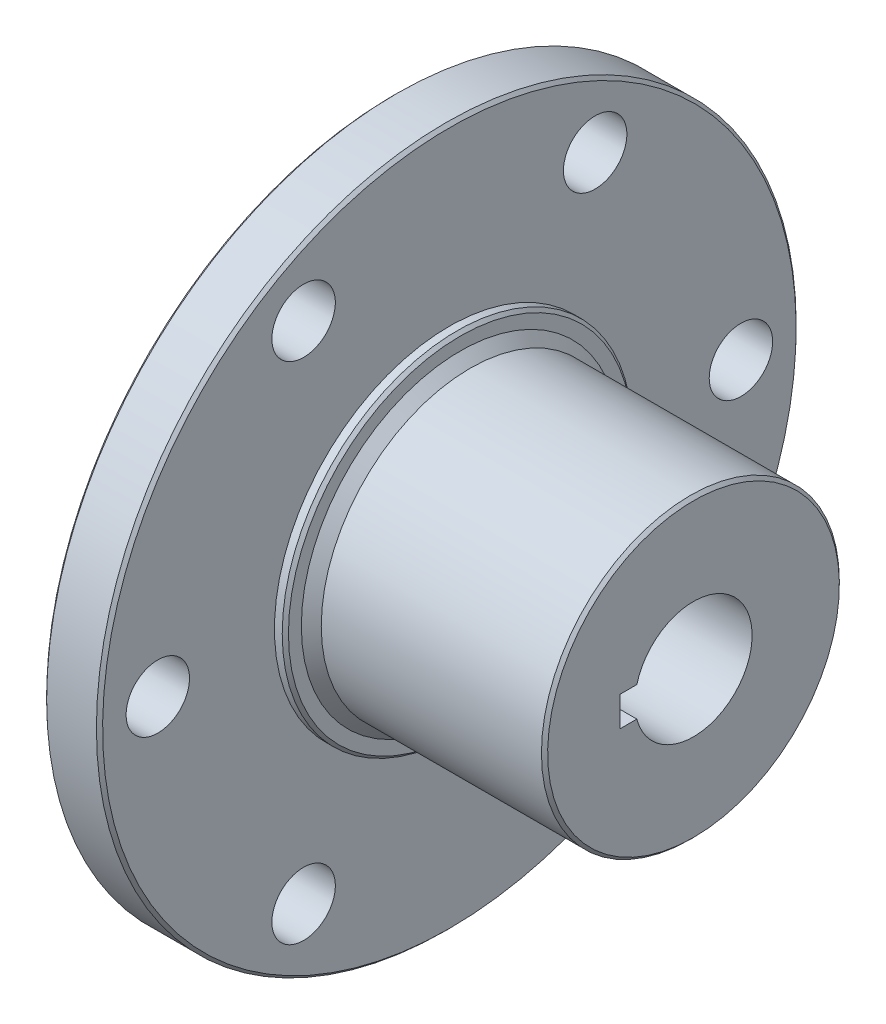
ISO-10303-21;
HEADER;
FILE_DESCRIPTION(('STEP AP214'),'2;1');
FILE_NAME('part.step','',(''),(''),'','','');
FILE_SCHEMA(('AUTOMOTIVE_DESIGN { 1 0 10303 214 1 1 1 1 }'));
ENDSEC;
DATA;
#1=APPLICATION_CONTEXT('core data for automotive mechanical design processes');
#2=APPLICATION_PROTOCOL_DEFINITION('international standard','automotive_design',2000,#1);
#3=PRODUCT_CONTEXT('',#1,'mechanical');
#4=PRODUCT('Part','Part','',(#3));
#5=PRODUCT_RELATED_PRODUCT_CATEGORY('part','',(#4));
#6=PRODUCT_DEFINITION_FORMATION('','',#4);
#7=PRODUCT_DEFINITION_CONTEXT('part definition',#1,'design');
#8=PRODUCT_DEFINITION('design','',#6,#7);
#9=PRODUCT_DEFINITION_SHAPE('','',#8);
#10=(LENGTH_UNIT() NAMED_UNIT(*) SI_UNIT(.MILLI.,.METRE.));
#11=(NAMED_UNIT(*) PLANE_ANGLE_UNIT() SI_UNIT($,.RADIAN.));
#12=(NAMED_UNIT(*) SI_UNIT($,.STERADIAN.) SOLID_ANGLE_UNIT());
#13=UNCERTAINTY_MEASURE_WITH_UNIT(LENGTH_MEASURE(1.E-05),#10,'distance_accuracy_value','');
#14=(GEOMETRIC_REPRESENTATION_CONTEXT(3) GLOBAL_UNCERTAINTY_ASSIGNED_CONTEXT((#13)) GLOBAL_UNIT_ASSIGNED_CONTEXT((#10,
#11,#12)) REPRESENTATION_CONTEXT('',''));
#15=CARTESIAN_POINT('',(0.,0.,0.));
#16=DIRECTION('',(0.,0.,1.));
#17=DIRECTION('',(1.,0.,0.));
#18=AXIS2_PLACEMENT_3D('',#15,#16,#17);
#19=CARTESIAN_POINT('',(7.79293375394319,-1.2192,4.63006887313785));
#20=DIRECTION('',(0.,-1.,0.));
#21=DIRECTION('',(0.,0.,-1.));
#22=AXIS2_PLACEMENT_3D('',#19,#20,#21);
#23=PLANE('',#22);
#24=DIRECTION('',(1.,0.,0.));
#25=VECTOR('',#24,1.);
#26=CARTESIAN_POINT('',(7.79293375394319,-1.2192,6.0071));
#27=LINE('',#26,#25);
#28=CARTESIAN_POINT('',(-17.6070662460568,-1.2192,6.0071));
#29=VERTEX_POINT('',#28);
#30=CARTESIAN_POINT('',(7.79293375394319,-1.2192,6.0071));
#31=VERTEX_POINT('',#30);
#32=EDGE_CURVE('E62',#29,#31,#27,.T.);
#33=ORIENTED_EDGE('',*,*,#32,.T.);
#34=DIRECTION('',(0.,0.,-1.));
#35=VECTOR('',#34,1.);
#36=CARTESIAN_POINT('',(7.79293375394319,-1.2192,0.));
#37=LINE('',#36,#35);
#38=CARTESIAN_POINT('',(7.79293375394319,-1.2192,4.63006887313785));
#39=VERTEX_POINT('',#38);
#40=EDGE_CURVE('E58',#39,#31,#37,.F.);
#41=ORIENTED_EDGE('',*,*,#40,.F.);
#42=DIRECTION('',(-1.,0.,0.));
#43=VECTOR('',#42,1.);
#44=CARTESIAN_POINT('',(7.79293375394323,-1.2192,4.63006887313785));
#45=LINE('',#44,#43);
#46=CARTESIAN_POINT('',(-17.6070662460568,-1.2192,4.63006887313785));
#47=VERTEX_POINT('',#46);
#48=EDGE_CURVE('E60',#39,#47,#45,.T.);
#49=ORIENTED_EDGE('',*,*,#48,.T.);
#50=DIRECTION('',(0.,0.,-1.));
#51=VECTOR('',#50,1.);
#52=CARTESIAN_POINT('',(-17.6070662460568,-1.2192,4.63006887313785));
#53=LINE('',#52,#51);
#54=EDGE_CURVE('E35',#29,#47,#53,.T.);
#55=ORIENTED_EDGE('',*,*,#54,.F.);
#56=EDGE_LOOP('',(#33,#41,#49,#55));
#57=FACE_BOUND('',#56,.T.);
#58=ADVANCED_FACE('F17',(#57),#23,.F.);
#59=CARTESIAN_POINT('',(7.79293375394319,0.,0.));
#60=DIRECTION('',(1.,0.,0.));
#61=DIRECTION('',(0.,0.,-1.));
#62=AXIS2_PLACEMENT_3D('',#59,#60,#61);
#63=PLANE('',#62);
#64=DIRECTION('',(0.,-1.,0.));
#65=VECTOR('',#64,1.);
#66=CARTESIAN_POINT('',(7.79293375394319,-1.2192,6.0071));
#67=LINE('',#66,#65);
#68=CARTESIAN_POINT('',(7.79293375394319,1.2192,6.0071));
#69=VERTEX_POINT('',#68);
#70=EDGE_CURVE('E100',#31,#69,#67,.F.);
#71=ORIENTED_EDGE('',*,*,#70,.T.);
#72=DIRECTION('',(0.,0.,1.));
#73=VECTOR('',#72,1.);
#74=CARTESIAN_POINT('',(7.79293375394319,1.2192,6.0071));
#75=LINE('',#74,#73);
#76=CARTESIAN_POINT('',(7.79293375394319,1.2192,4.63006887313785));
#77=VERTEX_POINT('',#76);
#78=EDGE_CURVE('E54',#69,#77,#75,.F.);
#79=ORIENTED_EDGE('',*,*,#78,.T.);
#80=CARTESIAN_POINT('',(7.79293375394319,0.,0.));
#81=DIRECTION('',(-1.,0.,0.));
#82=DIRECTION('',(0.,0.,1.));
#83=AXIS2_PLACEMENT_3D('',#80,#81,#82);
#84=CIRCLE('',#83,4.7879);
#85=EDGE_CURVE('E66',#77,#39,#84,.T.);
#86=ORIENTED_EDGE('',*,*,#85,.T.);
#87=ORIENTED_EDGE('',*,*,#40,.T.);
#88=EDGE_LOOP('',(#71,#79,#86,#87));
#89=FACE_BOUND('',#88,.T.);
#90=CARTESIAN_POINT('',(7.79293375394319,0.,0.));
#91=DIRECTION('',(-1.,0.,0.));
#92=DIRECTION('',(0.,-1.,0.));
#93=AXIS2_PLACEMENT_3D('',#90,#91,#92);
#94=CIRCLE('',#93,11.9126);
#95=CARTESIAN_POINT('',(7.79293375394319,-11.9126,0.));
#96=VERTEX_POINT('',#95);
#97=EDGE_CURVE('E20',#96,#96,#94,.T.);
#98=ORIENTED_EDGE('',*,*,#97,.F.);
#99=EDGE_LOOP('',(#98));
#100=FACE_BOUND('',#99,.T.);
#101=ADVANCED_FACE('F67',(#89,#100),#63,.T.);
#102=CARTESIAN_POINT('',(7.79293375394319,1.2192,6.0071));
#103=DIRECTION('',(0.,1.,0.));
#104=DIRECTION('',(0.,0.,1.));
#105=AXIS2_PLACEMENT_3D('',#102,#103,#104);
#106=PLANE('',#105);
#107=DIRECTION('',(-1.,0.,0.));
#108=VECTOR('',#107,1.);
#109=CARTESIAN_POINT('',(7.79293375394323,1.2192,4.63006887313785));
#110=LINE('',#109,#108);
#111=CARTESIAN_POINT('',(-17.6070662460568,1.2192,4.63006887313785));
#112=VERTEX_POINT('',#111);
#113=EDGE_CURVE('E71',#112,#77,#110,.F.);
#114=ORIENTED_EDGE('',*,*,#113,.T.);
#115=ORIENTED_EDGE('',*,*,#78,.F.);
#116=DIRECTION('',(1.,0.,0.));
#117=VECTOR('',#116,1.);
#118=CARTESIAN_POINT('',(7.79293375394319,1.2192,6.0071));
#119=LINE('',#118,#117);
#120=CARTESIAN_POINT('',(-17.6070662460568,1.2192,6.0071));
#121=VERTEX_POINT('',#120);
#122=EDGE_CURVE('E85',#69,#121,#119,.F.);
#123=ORIENTED_EDGE('',*,*,#122,.T.);
#124=DIRECTION('',(0.,0.,1.));
#125=VECTOR('',#124,1.);
#126=CARTESIAN_POINT('',(-17.6070662460568,1.2192,6.0071));
#127=LINE('',#126,#125);
#128=EDGE_CURVE('E78',#112,#121,#127,.T.);
#129=ORIENTED_EDGE('',*,*,#128,.F.);
#130=EDGE_LOOP('',(#114,#115,#123,#129));
#131=FACE_BOUND('',#130,.T.);
#132=ADVANCED_FACE('F179',(#131),#106,.F.);
#133=CARTESIAN_POINT('',(7.53893375394322,0.,0.));
#134=DIRECTION('',(-1.,0.,0.));
#135=DIRECTION('',(0.,-1.,0.));
#136=AXIS2_PLACEMENT_3D('',#133,#134,#135);
#137=CONICAL_SURFACE('',#136,12.1666,0.785398163397438);
#138=ORIENTED_EDGE('',*,*,#97,.T.);
#139=EDGE_LOOP('',(#138));
#140=FACE_BOUND('',#139,.T.);
#141=CARTESIAN_POINT('',(7.53893375394322,0.,0.));
#142=DIRECTION('',(-1.,0.,0.));
#143=DIRECTION('',(0.,0.,1.));
#144=AXIS2_PLACEMENT_3D('',#141,#142,#143);
#145=CIRCLE('',#144,12.1666);
#146=CARTESIAN_POINT('',(7.53893375394322,0.,12.1666));
#147=VERTEX_POINT('',#146);
#148=EDGE_CURVE('E83',#147,#147,#145,.T.);
#149=ORIENTED_EDGE('',*,*,#148,.F.);
#150=EDGE_LOOP('',(#149));
#151=FACE_BOUND('',#150,.T.);
#152=ADVANCED_FACE('F181',(#140,#151),#137,.T.);
#153=CARTESIAN_POINT('',(7.79293375394323,0.,0.));
#154=DIRECTION('',(-1.,0.,0.));
#155=DIRECTION('',(0.,0.,1.));
#156=AXIS2_PLACEMENT_3D('',#153,#154,#155);
#157=CYLINDRICAL_SURFACE('',#156,4.7879);
#158=ORIENTED_EDGE('',*,*,#113,.F.);
#159=CARTESIAN_POINT('',(-17.6070662460568,0.,0.));
#160=DIRECTION('',(-1.,0.,0.));
#161=DIRECTION('',(0.,0.,1.));
#162=AXIS2_PLACEMENT_3D('',#159,#160,#161);
#163=CIRCLE('',#162,4.7879);
#164=EDGE_CURVE('E74',#47,#112,#163,.F.);
#165=ORIENTED_EDGE('',*,*,#164,.F.);
#166=ORIENTED_EDGE('',*,*,#48,.F.);
#167=ORIENTED_EDGE('',*,*,#85,.F.);
#168=EDGE_LOOP('',(#158,#165,#166,#167));
#169=FACE_BOUND('',#168,.T.);
#170=ADVANCED_FACE('F72',(#169),#157,.F.);
#171=CARTESIAN_POINT('',(7.79293375394319,-1.2192,6.0071));
#172=DIRECTION('',(0.,0.,1.));
#173=DIRECTION('',(0.,-1.,0.));
#174=AXIS2_PLACEMENT_3D('',#171,#172,#173);
#175=PLANE('',#174);
#176=ORIENTED_EDGE('',*,*,#122,.F.);
#177=ORIENTED_EDGE('',*,*,#70,.F.);
#178=ORIENTED_EDGE('',*,*,#32,.F.);
#179=DIRECTION('',(0.,1.,0.));
#180=VECTOR('',#179,1.);
#181=CARTESIAN_POINT('',(-17.6070662460568,28.575,6.0071));
#182=LINE('',#181,#180);
#183=EDGE_CURVE('E103',#121,#29,#182,.F.);
#184=ORIENTED_EDGE('',*,*,#183,.F.);
#185=EDGE_LOOP('',(#176,#177,#178,#184));
#186=FACE_BOUND('',#185,.T.);
#187=ADVANCED_FACE('F177',(#186),#175,.F.);
#188=CARTESIAN_POINT('',(7.79293375394319,0.,0.));
#189=DIRECTION('',(-1.,0.,0.));
#190=DIRECTION('',(0.,0.,1.));
#191=AXIS2_PLACEMENT_3D('',#188,#189,#190);
#192=CYLINDRICAL_SURFACE('',#191,12.1666);
#193=ORIENTED_EDGE('',*,*,#148,.T.);
#194=EDGE_LOOP('',(#193));
#195=FACE_BOUND('',#194,.T.);
#196=CARTESIAN_POINT('',(-10.4442662460568,0.,0.));
#197=DIRECTION('',(-1.,0.,0.));
#198=DIRECTION('',(0.,0.,1.));
#199=AXIS2_PLACEMENT_3D('',#196,#197,#198);
#200=CIRCLE('',#199,12.1666);
#201=CARTESIAN_POINT('',(-10.4442662460568,0.,12.1666));
#202=VERTEX_POINT('',#201);
#203=EDGE_CURVE('E80',#202,#202,#200,.T.);
#204=ORIENTED_EDGE('',*,*,#203,.F.);
#205=EDGE_LOOP('',(#204));
#206=FACE_BOUND('',#205,.T.);
#207=ADVANCED_FACE('F264',(#195,#206),#192,.T.);
#208=CARTESIAN_POINT('',(-17.6070662460568,28.575,0.));
#209=DIRECTION('',(-1.,0.,0.));
#210=DIRECTION('',(0.,0.,1.));
#211=AXIS2_PLACEMENT_3D('',#208,#209,#210);
#212=PLANE('',#211);
#213=ORIENTED_EDGE('',*,*,#183,.T.);
#214=ORIENTED_EDGE('',*,*,#54,.T.);
#215=ORIENTED_EDGE('',*,*,#164,.T.);
#216=ORIENTED_EDGE('',*,*,#128,.T.);
#217=EDGE_LOOP('',(#213,#214,#215,#216));
#218=FACE_BOUND('',#217,.T.);
#219=CARTESIAN_POINT('',(-17.6070662460568,0.,0.));
#220=DIRECTION('',(1.,0.,0.));
#221=DIRECTION('',(0.,1.,0.));
#222=AXIS2_PLACEMENT_3D('',#219,#220,#221);
#223=CIRCLE('',#222,14.0335);
#224=CARTESIAN_POINT('',(-17.6070662460568,14.0335,0.));
#225=VERTEX_POINT('',#224);
#226=EDGE_CURVE('E168',#225,#225,#223,.T.);
#227=ORIENTED_EDGE('',*,*,#226,.F.);
#228=EDGE_LOOP('',(#227));
#229=FACE_BOUND('',#228,.T.);
#230=ADVANCED_FACE('F172',(#218,#229),#212,.T.);
#231=CARTESIAN_POINT('',(-11.2570662460568,0.,0.));
#232=DIRECTION('',(-1.,0.,0.));
#233=DIRECTION('',(0.,0.,1.));
#234=AXIS2_PLACEMENT_3D('',#231,#232,#233);
#235=CONICAL_SURFACE('',#234,12.9794,0.785398163397439);
#236=ORIENTED_EDGE('',*,*,#203,.T.);
#237=EDGE_LOOP('',(#236));
#238=FACE_BOUND('',#237,.T.);
#239=CARTESIAN_POINT('',(-11.2570662460568,0.,0.));
#240=DIRECTION('',(-1.,0.,0.));
#241=DIRECTION('',(0.,0.,1.));
#242=AXIS2_PLACEMENT_3D('',#239,#240,#241);
#243=CIRCLE('',#242,12.9794);
#244=CARTESIAN_POINT('',(-11.2570662460568,0.,12.9794));
#245=VERTEX_POINT('',#244);
#246=EDGE_CURVE('E164',#245,#245,#243,.T.);
#247=ORIENTED_EDGE('',*,*,#246,.F.);
#248=EDGE_LOOP('',(#247));
#249=FACE_BOUND('',#248,.T.);
#250=ADVANCED_FACE('F257',(#238,#249),#235,.T.);
#251=CARTESIAN_POINT('',(-17.3530662460568,0.,0.));
#252=DIRECTION('',(1.,0.,0.));
#253=DIRECTION('',(0.,1.,0.));
#254=AXIS2_PLACEMENT_3D('',#251,#252,#253);
#255=CONICAL_SURFACE('',#254,14.2875,0.785398163397452);
#256=CARTESIAN_POINT('',(-17.3530662460568,0.,0.));
#257=DIRECTION('',(1.,0.,0.));
#258=DIRECTION('',(0.,0.,-1.));
#259=AXIS2_PLACEMENT_3D('',#256,#257,#258);
#260=CIRCLE('',#259,14.2875);
#261=CARTESIAN_POINT('',(-17.3530662460568,0.,-14.2875));
#262=VERTEX_POINT('',#261);
#263=EDGE_CURVE('E167',#262,#262,#260,.T.);
#264=ORIENTED_EDGE('',*,*,#263,.F.);
#265=EDGE_LOOP('',(#264));
#266=FACE_BOUND('',#265,.T.);
#267=ORIENTED_EDGE('',*,*,#226,.T.);
#268=EDGE_LOOP('',(#267));
#269=FACE_BOUND('',#268,.T.);
#270=ADVANCED_FACE('F253',(#266,#269),#255,.T.);
#271=CARTESIAN_POINT('',(-11.2570662460568,0.,0.));
#272=DIRECTION('',(1.,0.,0.));
#273=DIRECTION('',(0.,0.,-1.));
#274=AXIS2_PLACEMENT_3D('',#271,#272,#273);
#275=PLANE('',#274);
#276=CARTESIAN_POINT('',(-11.2570662460568,0.,0.));
#277=DIRECTION('',(-1.,0.,0.));
#278=DIRECTION('',(0.,0.,1.));
#279=AXIS2_PLACEMENT_3D('',#276,#277,#278);
#280=CIRCLE('',#279,14.0335);
#281=CARTESIAN_POINT('',(-11.2570662460568,0.,14.0335));
#282=VERTEX_POINT('',#281);
#283=EDGE_CURVE('E160',#282,#282,#280,.T.);
#284=ORIENTED_EDGE('',*,*,#283,.F.);
#285=EDGE_LOOP('',(#284));
#286=FACE_BOUND('',#285,.T.);
#287=ORIENTED_EDGE('',*,*,#246,.T.);
#288=EDGE_LOOP('',(#287));
#289=FACE_BOUND('',#288,.T.);
#290=ADVANCED_FACE('F249',(#286,#289),#275,.T.);
#291=CARTESIAN_POINT('',(-16.4640662460568,0.,0.));
#292=DIRECTION('',(1.,0.,0.));
#293=DIRECTION('',(0.,0.,-1.));
#294=AXIS2_PLACEMENT_3D('',#291,#292,#293);
#295=CONICAL_SURFACE('',#294,28.575,0.785398163397448);
#296=CARTESIAN_POINT('',(-16.7180662460568,0.,0.));
#297=DIRECTION('',(1.,0.,0.));
#298=DIRECTION('',(0.,0.,-1.));
#299=AXIS2_PLACEMENT_3D('',#296,#297,#298);
#300=CIRCLE('',#299,28.321);
#301=CARTESIAN_POINT('',(-16.7180662460568,0.,-28.321));
#302=VERTEX_POINT('',#301);
#303=EDGE_CURVE('E157',#302,#302,#300,.T.);
#304=ORIENTED_EDGE('',*,*,#303,.T.);
#305=EDGE_LOOP('',(#304));
#306=FACE_BOUND('',#305,.T.);
#307=CARTESIAN_POINT('',(-16.4640662460568,0.,0.));
#308=DIRECTION('',(1.,0.,0.));
#309=DIRECTION('',(0.,0.,-1.));
#310=AXIS2_PLACEMENT_3D('',#307,#308,#309);
#311=CIRCLE('',#310,28.575);
#312=CARTESIAN_POINT('',(-16.4640662460568,0.,-28.575));
#313=VERTEX_POINT('',#312);
#314=EDGE_CURVE('E163',#313,#313,#311,.T.);
#315=ORIENTED_EDGE('',*,*,#314,.F.);
#316=EDGE_LOOP('',(#315));
#317=FACE_BOUND('',#316,.T.);
#318=ADVANCED_FACE('F245',(#306,#317),#295,.T.);
#319=CARTESIAN_POINT('',(15.6289757853187,0.,0.));
#320=DIRECTION('',(1.,0.,0.));
#321=DIRECTION('',(0.,0.,-1.));
#322=AXIS2_PLACEMENT_3D('',#319,#320,#321);
#323=CYLINDRICAL_SURFACE('',#322,14.2875);
#324=CARTESIAN_POINT('',(-16.7180662460568,0.,0.));
#325=DIRECTION('',(1.,0.,0.));
#326=DIRECTION('',(0.,0.,-1.));
#327=AXIS2_PLACEMENT_3D('',#324,#325,#326);
#328=CIRCLE('',#327,14.2875);
#329=CARTESIAN_POINT('',(-16.7180662460568,0.,-14.2875));
#330=VERTEX_POINT('',#329);
#331=EDGE_CURVE('E154',#330,#330,#328,.F.);
#332=ORIENTED_EDGE('',*,*,#331,.T.);
#333=EDGE_LOOP('',(#332));
#334=FACE_BOUND('',#333,.T.);
#335=ORIENTED_EDGE('',*,*,#263,.T.);
#336=EDGE_LOOP('',(#335));
#337=FACE_BOUND('',#336,.T.);
#338=ADVANCED_FACE('F241',(#334,#337),#323,.T.);
#339=CARTESIAN_POINT('',(-17.6070662460568,0.,0.));
#340=DIRECTION('',(1.,0.,0.));
#341=DIRECTION('',(0.,0.,-1.));
#342=AXIS2_PLACEMENT_3D('',#339,#340,#341);
#343=CYLINDRICAL_SURFACE('',#342,28.575);
#344=CARTESIAN_POINT('',(-12.4000662460568,0.,0.));
#345=DIRECTION('',(-1.,0.,0.));
#346=DIRECTION('',(0.,0.,1.));
#347=AXIS2_PLACEMENT_3D('',#344,#345,#346);
#348=CIRCLE('',#347,28.575);
#349=CARTESIAN_POINT('',(-12.4000662460568,0.,28.575));
#350=VERTEX_POINT('',#349);
#351=EDGE_CURVE('E153',#350,#350,#348,.F.);
#352=ORIENTED_EDGE('',*,*,#351,.F.);
#353=EDGE_LOOP('',(#352));
#354=FACE_BOUND('',#353,.T.);
#355=ORIENTED_EDGE('',*,*,#314,.T.);
#356=EDGE_LOOP('',(#355));
#357=FACE_BOUND('',#356,.T.);
#358=ADVANCED_FACE('F237',(#354,#357),#343,.T.);
#359=CARTESIAN_POINT('',(-11.5110662460568,0.,0.));
#360=DIRECTION('',(-1.,0.,0.));
#361=DIRECTION('',(0.,0.,1.));
#362=AXIS2_PLACEMENT_3D('',#359,#360,#361);
#363=CONICAL_SURFACE('',#362,14.2875,0.785398163397465);
#364=ORIENTED_EDGE('',*,*,#283,.T.);
#365=EDGE_LOOP('',(#364));
#366=FACE_BOUND('',#365,.T.);
#367=CARTESIAN_POINT('',(-11.5110662460568,0.,0.));
#368=DIRECTION('',(1.,0.,0.));
#369=DIRECTION('',(0.,0.,-1.));
#370=AXIS2_PLACEMENT_3D('',#367,#368,#369);
#371=CIRCLE('',#370,14.2875);
#372=CARTESIAN_POINT('',(-11.5110662460568,0.,-14.2875));
#373=VERTEX_POINT('',#372);
#374=EDGE_CURVE('E143',#373,#373,#371,.F.);
#375=ORIENTED_EDGE('',*,*,#374,.F.);
#376=EDGE_LOOP('',(#375));
#377=FACE_BOUND('',#376,.T.);
#378=ADVANCED_FACE('F233',(#366,#377),#363,.T.);
#379=CARTESIAN_POINT('',(-16.7180662460568,0.,8.02883825303254));
#380=DIRECTION('',(1.,0.,0.));
#381=DIRECTION('',(0.,0.,-1.));
#382=AXIS2_PLACEMENT_3D('',#379,#380,#381);
#383=PLANE('',#382);
#384=CARTESIAN_POINT('',(-16.7180662460568,0.,23.8125));
#385=DIRECTION('',(-1.,0.,0.));
#386=DIRECTION('',(0.,0.,1.));
#387=AXIS2_PLACEMENT_3D('',#384,#385,#386);
#388=CIRCLE('',#387,2.59080000000001);
#389=CARTESIAN_POINT('',(-16.7180662460568,0.,26.4033));
#390=VERTEX_POINT('',#389);
#391=EDGE_CURVE('E134',#390,#390,#388,.F.);
#392=ORIENTED_EDGE('',*,*,#391,.T.);
#393=EDGE_LOOP('',(#392));
#394=FACE_BOUND('',#393,.T.);
#395=CARTESIAN_POINT('',(-16.7180662460568,20.6222299276169,-11.9062500000001));
#396=DIRECTION('',(-1.,0.,0.));
#397=DIRECTION('',(0.,0.,1.));
#398=AXIS2_PLACEMENT_3D('',#395,#396,#397);
#399=CIRCLE('',#398,2.59080000000001);
#400=CARTESIAN_POINT('',(-16.7180662460568,20.6222299276169,-9.31545000000008));
#401=VERTEX_POINT('',#400);
#402=EDGE_CURVE('E137',#401,#401,#399,.F.);
#403=ORIENTED_EDGE('',*,*,#402,.T.);
#404=EDGE_LOOP('',(#403));
#405=FACE_BOUND('',#404,.T.);
#406=CARTESIAN_POINT('',(-16.7180662460568,-20.6222299276171,-11.9062499999998));
#407=DIRECTION('',(-1.,0.,0.));
#408=DIRECTION('',(0.,0.,1.));
#409=AXIS2_PLACEMENT_3D('',#406,#407,#408);
#410=CIRCLE('',#409,2.59080000000001);
#411=CARTESIAN_POINT('',(-16.7180662460568,-20.6222299276171,-9.3154499999998));
#412=VERTEX_POINT('',#411);
#413=EDGE_CURVE('E140',#412,#412,#410,.F.);
#414=ORIENTED_EDGE('',*,*,#413,.T.);
#415=EDGE_LOOP('',(#414));
#416=FACE_BOUND('',#415,.T.);
#417=ORIENTED_EDGE('',*,*,#331,.F.);
#418=EDGE_LOOP('',(#417));
#419=FACE_BOUND('',#418,.T.);
#420=CARTESIAN_POINT('',(-16.7180662460568,-20.6222299276168,11.9062500000002));
#421=DIRECTION('',(-1.,0.,0.));
#422=DIRECTION('',(0.,0.,1.));
#423=AXIS2_PLACEMENT_3D('',#420,#421,#422);
#424=CIRCLE('',#423,2.59080000000001);
#425=CARTESIAN_POINT('',(-16.7180662460568,-20.6222299276168,14.4970500000003));
#426=VERTEX_POINT('',#425);
#427=EDGE_CURVE('E144',#426,#426,#424,.F.);
#428=ORIENTED_EDGE('',*,*,#427,.T.);
#429=EDGE_LOOP('',(#428));
#430=FACE_BOUND('',#429,.T.);
#431=CARTESIAN_POINT('',(-16.7180662460568,0.,-23.8125));
#432=DIRECTION('',(-1.,0.,0.));
#433=DIRECTION('',(0.,0.,1.));
#434=AXIS2_PLACEMENT_3D('',#431,#432,#433);
#435=CIRCLE('',#434,2.59080000000001);
#436=CARTESIAN_POINT('',(-16.7180662460568,0.,-21.2217));
#437=VERTEX_POINT('',#436);
#438=EDGE_CURVE('E147',#437,#437,#435,.F.);
#439=ORIENTED_EDGE('',*,*,#438,.T.);
#440=EDGE_LOOP('',(#439));
#441=FACE_BOUND('',#440,.T.);
#442=CARTESIAN_POINT('',(-16.7180662460568,20.622229927617,11.90625));
#443=DIRECTION('',(-1.,0.,0.));
#444=DIRECTION('',(0.,0.,1.));
#445=AXIS2_PLACEMENT_3D('',#442,#443,#444);
#446=CIRCLE('',#445,2.59080000000001);
#447=CARTESIAN_POINT('',(-16.7180662460568,20.622229927617,14.49705));
#448=VERTEX_POINT('',#447);
#449=EDGE_CURVE('E150',#448,#448,#446,.F.);
#450=ORIENTED_EDGE('',*,*,#449,.T.);
#451=EDGE_LOOP('',(#450));
#452=FACE_BOUND('',#451,.T.);
#453=ORIENTED_EDGE('',*,*,#303,.F.);
#454=EDGE_LOOP('',(#453));
#455=FACE_BOUND('',#454,.T.);
#456=ADVANCED_FACE('F229',(#394,#405,#416,#419,#430,#441,#452,#455),#383,.F.);
#457=CARTESIAN_POINT('',(-12.4000662460568,0.,0.));
#458=DIRECTION('',(-1.,0.,0.));
#459=DIRECTION('',(0.,-1.,0.));
#460=AXIS2_PLACEMENT_3D('',#457,#458,#459);
#461=CONICAL_SURFACE('',#460,28.575,0.785398163397445);
#462=ORIENTED_EDGE('',*,*,#351,.T.);
#463=EDGE_LOOP('',(#462));
#464=FACE_BOUND('',#463,.T.);
#465=CARTESIAN_POINT('',(-12.1460662460568,0.,0.));
#466=DIRECTION('',(-1.,0.,0.));
#467=DIRECTION('',(0.,-1.,0.));
#468=AXIS2_PLACEMENT_3D('',#465,#466,#467);
#469=CIRCLE('',#468,28.321);
#470=CARTESIAN_POINT('',(-12.1460662460568,-28.321,0.));
#471=VERTEX_POINT('',#470);
#472=EDGE_CURVE('E131',#471,#471,#469,.F.);
#473=ORIENTED_EDGE('',*,*,#472,.F.);
#474=EDGE_LOOP('',(#473));
#475=FACE_BOUND('',#474,.T.);
#476=ADVANCED_FACE('F225',(#464,#475),#461,.T.);
#477=CARTESIAN_POINT('',(-17.6070662460568,20.622229927617,11.90625));
#478=DIRECTION('',(-1.,0.,0.));
#479=DIRECTION('',(0.,0.,1.));
#480=AXIS2_PLACEMENT_3D('',#477,#478,#479);
#481=CYLINDRICAL_SURFACE('',#480,2.59080000000001);
#482=ORIENTED_EDGE('',*,*,#449,.F.);
#483=EDGE_LOOP('',(#482));
#484=FACE_BOUND('',#483,.T.);
#485=CARTESIAN_POINT('',(-12.1460662460568,20.622229927617,11.90625));
#486=DIRECTION('',(-1.,0.,0.));
#487=DIRECTION('',(0.,0.,1.));
#488=AXIS2_PLACEMENT_3D('',#485,#486,#487);
#489=CIRCLE('',#488,2.59080000000001);
#490=CARTESIAN_POINT('',(-12.1460662460568,20.622229927617,14.49705));
#491=VERTEX_POINT('',#490);
#492=EDGE_CURVE('E128',#491,#491,#489,.T.);
#493=ORIENTED_EDGE('',*,*,#492,.F.);
#494=EDGE_LOOP('',(#493));
#495=FACE_BOUND('',#494,.T.);
#496=ADVANCED_FACE('F221',(#484,#495),#481,.F.);
#497=CARTESIAN_POINT('',(-17.6070662460568,0.,-23.8125));
#498=DIRECTION('',(-1.,0.,0.));
#499=DIRECTION('',(0.,0.,1.));
#500=AXIS2_PLACEMENT_3D('',#497,#498,#499);
#501=CYLINDRICAL_SURFACE('',#500,2.59080000000001);
#502=ORIENTED_EDGE('',*,*,#438,.F.);
#503=EDGE_LOOP('',(#502));
#504=FACE_BOUND('',#503,.T.);
#505=CARTESIAN_POINT('',(-12.1460662460568,0.,-23.8125));
#506=DIRECTION('',(-1.,0.,0.));
#507=DIRECTION('',(0.,0.,1.));
#508=AXIS2_PLACEMENT_3D('',#505,#506,#507);
#509=CIRCLE('',#508,2.59080000000001);
#510=CARTESIAN_POINT('',(-12.1460662460568,0.,-21.2217));
#511=VERTEX_POINT('',#510);
#512=EDGE_CURVE('E125',#511,#511,#509,.T.);
#513=ORIENTED_EDGE('',*,*,#512,.F.);
#514=EDGE_LOOP('',(#513));
#515=FACE_BOUND('',#514,.T.);
#516=ADVANCED_FACE('F217',(#504,#515),#501,.F.);
#517=CARTESIAN_POINT('',(-17.6070662460568,-20.6222299276168,11.9062500000002));
#518=DIRECTION('',(-1.,0.,0.));
#519=DIRECTION('',(0.,0.,1.));
#520=AXIS2_PLACEMENT_3D('',#517,#518,#519);
#521=CYLINDRICAL_SURFACE('',#520,2.59080000000001);
#522=ORIENTED_EDGE('',*,*,#427,.F.);
#523=EDGE_LOOP('',(#522));
#524=FACE_BOUND('',#523,.T.);
#525=CARTESIAN_POINT('',(-12.1460662460568,-20.6222299276168,11.9062500000002));
#526=DIRECTION('',(-1.,0.,0.));
#527=DIRECTION('',(0.,0.,1.));
#528=AXIS2_PLACEMENT_3D('',#525,#526,#527);
#529=CIRCLE('',#528,2.59080000000001);
#530=CARTESIAN_POINT('',(-12.1460662460568,-20.6222299276168,14.4970500000003));
#531=VERTEX_POINT('',#530);
#532=EDGE_CURVE('E122',#531,#531,#529,.T.);
#533=ORIENTED_EDGE('',*,*,#532,.F.);
#534=EDGE_LOOP('',(#533));
#535=FACE_BOUND('',#534,.T.);
#536=ADVANCED_FACE('F213',(#524,#535),#521,.F.);
#537=CARTESIAN_POINT('',(15.6289757853187,0.,0.));
#538=DIRECTION('',(1.,0.,0.));
#539=DIRECTION('',(0.,0.,-1.));
#540=AXIS2_PLACEMENT_3D('',#537,#538,#539);
#541=CYLINDRICAL_SURFACE('',#540,14.2875);
#542=CARTESIAN_POINT('',(-12.1460662460568,0.,0.));
#543=DIRECTION('',(1.,0.,0.));
#544=DIRECTION('',(0.,0.,-1.));
#545=AXIS2_PLACEMENT_3D('',#542,#543,#544);
#546=CIRCLE('',#545,14.2875);
#547=CARTESIAN_POINT('',(-12.1460662460568,0.,-14.2875));
#548=VERTEX_POINT('',#547);
#549=EDGE_CURVE('E119',#548,#548,#546,.F.);
#550=ORIENTED_EDGE('',*,*,#549,.F.);
#551=EDGE_LOOP('',(#550));
#552=FACE_BOUND('',#551,.T.);
#553=ORIENTED_EDGE('',*,*,#374,.T.);
#554=EDGE_LOOP('',(#553));
#555=FACE_BOUND('',#554,.T.);
#556=ADVANCED_FACE('F209',(#552,#555),#541,.T.);
#557=CARTESIAN_POINT('',(-17.6070662460568,-20.6222299276171,-11.9062499999998));
#558=DIRECTION('',(-1.,0.,0.));
#559=DIRECTION('',(0.,0.,1.));
#560=AXIS2_PLACEMENT_3D('',#557,#558,#559);
#561=CYLINDRICAL_SURFACE('',#560,2.59080000000001);
#562=ORIENTED_EDGE('',*,*,#413,.F.);
#563=EDGE_LOOP('',(#562));
#564=FACE_BOUND('',#563,.T.);
#565=CARTESIAN_POINT('',(-12.1460662460568,-20.6222299276171,-11.9062499999998));
#566=DIRECTION('',(-1.,0.,0.));
#567=DIRECTION('',(0.,0.,1.));
#568=AXIS2_PLACEMENT_3D('',#565,#566,#567);
#569=CIRCLE('',#568,2.59080000000001);
#570=CARTESIAN_POINT('',(-12.1460662460568,-20.6222299276171,-9.3154499999998));
#571=VERTEX_POINT('',#570);
#572=EDGE_CURVE('E116',#571,#571,#569,.T.);
#573=ORIENTED_EDGE('',*,*,#572,.F.);
#574=EDGE_LOOP('',(#573));
#575=FACE_BOUND('',#574,.T.);
#576=ADVANCED_FACE('F205',(#564,#575),#561,.F.);
#577=CARTESIAN_POINT('',(-17.6070662460568,20.6222299276169,-11.9062500000001));
#578=DIRECTION('',(-1.,0.,0.));
#579=DIRECTION('',(0.,0.,1.));
#580=AXIS2_PLACEMENT_3D('',#577,#578,#579);
#581=CYLINDRICAL_SURFACE('',#580,2.59080000000001);
#582=ORIENTED_EDGE('',*,*,#402,.F.);
#583=EDGE_LOOP('',(#582));
#584=FACE_BOUND('',#583,.T.);
#585=CARTESIAN_POINT('',(-12.1460662460568,20.6222299276169,-11.9062500000001));
#586=DIRECTION('',(-1.,0.,0.));
#587=DIRECTION('',(0.,0.,1.));
#588=AXIS2_PLACEMENT_3D('',#585,#586,#587);
#589=CIRCLE('',#588,2.59080000000001);
#590=CARTESIAN_POINT('',(-12.1460662460568,20.6222299276169,-9.31545000000008));
#591=VERTEX_POINT('',#590);
#592=EDGE_CURVE('E26',#591,#591,#589,.T.);
#593=ORIENTED_EDGE('',*,*,#592,.F.);
#594=EDGE_LOOP('',(#593));
#595=FACE_BOUND('',#594,.T.);
#596=ADVANCED_FACE('F198',(#584,#595),#581,.F.);
#597=CARTESIAN_POINT('',(-17.6070662460568,0.,23.8125));
#598=DIRECTION('',(-1.,0.,0.));
#599=DIRECTION('',(0.,0.,1.));
#600=AXIS2_PLACEMENT_3D('',#597,#598,#599);
#601=CYLINDRICAL_SURFACE('',#600,2.59080000000001);
#602=ORIENTED_EDGE('',*,*,#391,.F.);
#603=EDGE_LOOP('',(#602));
#604=FACE_BOUND('',#603,.T.);
#605=CARTESIAN_POINT('',(-12.1460662460568,0.,23.8125));
#606=DIRECTION('',(-1.,0.,0.));
#607=DIRECTION('',(0.,0.,1.));
#608=AXIS2_PLACEMENT_3D('',#605,#606,#607);
#609=CIRCLE('',#608,2.59080000000001);
#610=CARTESIAN_POINT('',(-12.1460662460568,0.,26.4033));
#611=VERTEX_POINT('',#610);
#612=EDGE_CURVE('E10',#611,#611,#609,.T.);
#613=ORIENTED_EDGE('',*,*,#612,.F.);
#614=EDGE_LOOP('',(#613));
#615=FACE_BOUND('',#614,.T.);
#616=ADVANCED_FACE('F192',(#604,#615),#601,.F.);
#617=CARTESIAN_POINT('',(-12.1460662460568,0.,8.02883825303253));
#618=DIRECTION('',(1.,0.,0.));
#619=DIRECTION('',(0.,0.,-1.));
#620=AXIS2_PLACEMENT_3D('',#617,#618,#619);
#621=PLANE('',#620);
#622=ORIENTED_EDGE('',*,*,#612,.T.);
#623=EDGE_LOOP('',(#622));
#624=FACE_BOUND('',#623,.T.);
#625=ORIENTED_EDGE('',*,*,#592,.T.);
#626=EDGE_LOOP('',(#625));
#627=FACE_BOUND('',#626,.T.);
#628=ORIENTED_EDGE('',*,*,#572,.T.);
#629=EDGE_LOOP('',(#628));
#630=FACE_BOUND('',#629,.T.);
#631=ORIENTED_EDGE('',*,*,#549,.T.);
#632=EDGE_LOOP('',(#631));
#633=FACE_BOUND('',#632,.T.);
#634=ORIENTED_EDGE('',*,*,#532,.T.);
#635=EDGE_LOOP('',(#634));
#636=FACE_BOUND('',#635,.T.);
#637=ORIENTED_EDGE('',*,*,#512,.T.);
#638=EDGE_LOOP('',(#637));
#639=FACE_BOUND('',#638,.T.);
#640=ORIENTED_EDGE('',*,*,#492,.T.);
#641=EDGE_LOOP('',(#640));
#642=FACE_BOUND('',#641,.T.);
#643=ORIENTED_EDGE('',*,*,#472,.T.);
#644=EDGE_LOOP('',(#643));
#645=FACE_BOUND('',#644,.T.);
#646=ADVANCED_FACE('F190',(#624,#627,#630,#633,#636,#639,#642,#645),#621,.T.);
#647=CLOSED_SHELL('',(#58,#101,#132,#152,#170,#187,#207,#230,#250,#270,#290,#318,#338,#358,#378,
#456,#476,#496,#516,#536,#556,#576,#596,#616,#646));
#648=MANIFOLD_SOLID_BREP('B1',#647);
#649=ADVANCED_BREP_SHAPE_REPRESENTATION('',(#18,#648),#14);
#650=SHAPE_DEFINITION_REPRESENTATION(#9,#649);
ENDSEC;
END-ISO-10303-21;
